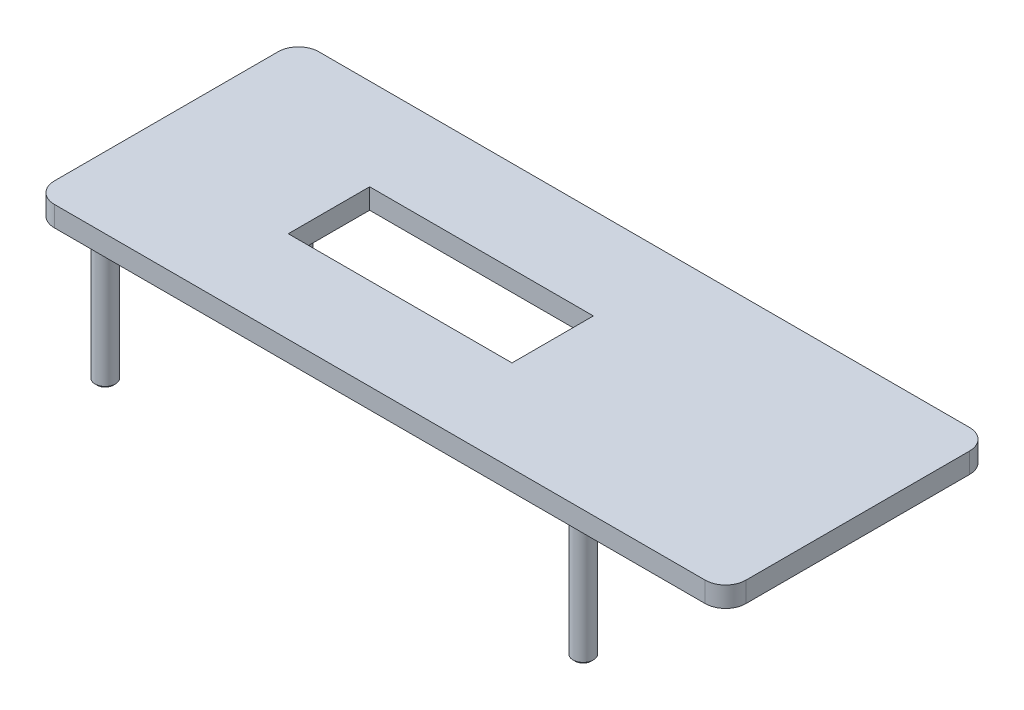
ISO-10303-21;
HEADER;
FILE_DESCRIPTION(('STEP AP214'),'2;1');
FILE_NAME('part.step','',(''),(''),'','','');
FILE_SCHEMA(('AUTOMOTIVE_DESIGN { 1 0 10303 214 1 1 1 1 }'));
ENDSEC;
DATA;
#1=APPLICATION_CONTEXT('core data for automotive mechanical design processes');
#2=APPLICATION_PROTOCOL_DEFINITION('international standard','automotive_design',2000,#1);
#3=PRODUCT_CONTEXT('',#1,'mechanical');
#4=PRODUCT('Part','Part','',(#3));
#5=PRODUCT_RELATED_PRODUCT_CATEGORY('part','',(#4));
#6=PRODUCT_DEFINITION_FORMATION('','',#4);
#7=PRODUCT_DEFINITION_CONTEXT('part definition',#1,'design');
#8=PRODUCT_DEFINITION('design','',#6,#7);
#9=PRODUCT_DEFINITION_SHAPE('','',#8);
#10=(LENGTH_UNIT() NAMED_UNIT(*) SI_UNIT(.MILLI.,.METRE.));
#11=(NAMED_UNIT(*) PLANE_ANGLE_UNIT() SI_UNIT($,.RADIAN.));
#12=(NAMED_UNIT(*) SI_UNIT($,.STERADIAN.) SOLID_ANGLE_UNIT());
#13=UNCERTAINTY_MEASURE_WITH_UNIT(LENGTH_MEASURE(1.E-05),#10,'distance_accuracy_value','');
#14=(GEOMETRIC_REPRESENTATION_CONTEXT(3) GLOBAL_UNCERTAINTY_ASSIGNED_CONTEXT((#13)) GLOBAL_UNIT_ASSIGNED_CONTEXT((#10,
#11,#12)) REPRESENTATION_CONTEXT('',''));
#15=CARTESIAN_POINT('',(0.,0.,0.));
#16=DIRECTION('',(0.,0.,1.));
#17=DIRECTION('',(1.,0.,0.));
#18=AXIS2_PLACEMENT_3D('',#15,#16,#17);
#19=CARTESIAN_POINT('',(16.,1.,-5.5));
#20=DIRECTION('',(0.,-1.,0.));
#21=DIRECTION('',(0.,0.,-1.));
#22=AXIS2_PLACEMENT_3D('',#19,#20,#21);
#23=CYLINDRICAL_SURFACE('',#22,1.);
#24=CARTESIAN_POINT('',(16.,0.,-5.5));
#25=DIRECTION('',(0.,1.,0.));
#26=DIRECTION('',(0.,0.,-1.));
#27=AXIS2_PLACEMENT_3D('',#24,#25,#26);
#28=CIRCLE('',#27,1.);
#29=CARTESIAN_POINT('',(17.,0.,-5.49999999999999));
#30=VERTEX_POINT('',#29);
#31=CARTESIAN_POINT('',(16.,0.,-6.5));
#32=VERTEX_POINT('',#31);
#33=EDGE_CURVE('E176',#30,#32,#28,.T.);
#34=ORIENTED_EDGE('',*,*,#33,.T.);
#35=DIRECTION('',(0.,-1.,0.));
#36=VECTOR('',#35,1.);
#37=CARTESIAN_POINT('',(16.,1.,-6.5));
#38=LINE('',#37,#36);
#39=CARTESIAN_POINT('',(16.,1.,-6.5));
#40=VERTEX_POINT('',#39);
#41=EDGE_CURVE('E254',#40,#32,#38,.T.);
#42=ORIENTED_EDGE('',*,*,#41,.F.);
#43=CARTESIAN_POINT('',(16.,1.,-5.5));
#44=DIRECTION('',(0.,1.,0.));
#45=DIRECTION('',(0.,0.,-1.));
#46=AXIS2_PLACEMENT_3D('',#43,#44,#45);
#47=CIRCLE('',#46,1.);
#48=CARTESIAN_POINT('',(17.,1.,-5.49999999999999));
#49=VERTEX_POINT('',#48);
#50=EDGE_CURVE('E177',#49,#40,#47,.T.);
#51=ORIENTED_EDGE('',*,*,#50,.F.);
#52=DIRECTION('',(0.,-1.,0.));
#53=VECTOR('',#52,1.);
#54=CARTESIAN_POINT('',(17.,1.,-5.49999999999999));
#55=LINE('',#54,#53);
#56=EDGE_CURVE('E203',#49,#30,#55,.T.);
#57=ORIENTED_EDGE('',*,*,#56,.T.);
#58=EDGE_LOOP('',(#34,#42,#51,#57));
#59=FACE_BOUND('',#58,.T.);
#60=ADVANCED_FACE('F41',(#59),#23,.T.);
#61=CARTESIAN_POINT('',(-16.,1.,-6.5));
#62=DIRECTION('',(0.,0.,1.));
#63=DIRECTION('',(1.,0.,0.));
#64=AXIS2_PLACEMENT_3D('',#61,#62,#63);
#65=PLANE('',#64);
#66=DIRECTION('',(-1.,0.,0.));
#67=VECTOR('',#66,1.);
#68=CARTESIAN_POINT('',(-16.,0.,-6.5));
#69=LINE('',#68,#67);
#70=CARTESIAN_POINT('',(-16.,0.,-6.5));
#71=VERTEX_POINT('',#70);
#72=EDGE_CURVE('E207',#32,#71,#69,.T.);
#73=ORIENTED_EDGE('',*,*,#72,.T.);
#74=DIRECTION('',(0.,-1.,0.));
#75=VECTOR('',#74,1.);
#76=CARTESIAN_POINT('',(-16.,1.,-6.5));
#77=LINE('',#76,#75);
#78=CARTESIAN_POINT('',(-16.,1.,-6.5));
#79=VERTEX_POINT('',#78);
#80=EDGE_CURVE('E250',#79,#71,#77,.T.);
#81=ORIENTED_EDGE('',*,*,#80,.F.);
#82=DIRECTION('',(-1.,0.,0.));
#83=VECTOR('',#82,1.);
#84=CARTESIAN_POINT('',(-16.,1.,-6.5));
#85=LINE('',#84,#83);
#86=EDGE_CURVE('E181',#40,#79,#85,.T.);
#87=ORIENTED_EDGE('',*,*,#86,.F.);
#88=ORIENTED_EDGE('',*,*,#41,.T.);
#89=EDGE_LOOP('',(#73,#81,#87,#88));
#90=FACE_BOUND('',#89,.T.);
#91=ADVANCED_FACE('F308',(#90),#65,.F.);
#92=CARTESIAN_POINT('',(-16.,1.,-5.5));
#93=DIRECTION('',(0.,-1.,0.));
#94=DIRECTION('',(0.,0.,-1.));
#95=AXIS2_PLACEMENT_3D('',#92,#93,#94);
#96=CYLINDRICAL_SURFACE('',#95,1.);
#97=CARTESIAN_POINT('',(-16.,0.,-5.5));
#98=DIRECTION('',(0.,1.,0.));
#99=DIRECTION('',(0.,0.,-1.));
#100=AXIS2_PLACEMENT_3D('',#97,#98,#99);
#101=CIRCLE('',#100,1.);
#102=CARTESIAN_POINT('',(-17.,0.,-5.49999999999999));
#103=VERTEX_POINT('',#102);
#104=EDGE_CURVE('E210',#71,#103,#101,.T.);
#105=ORIENTED_EDGE('',*,*,#104,.T.);
#106=DIRECTION('',(0.,-1.,0.));
#107=VECTOR('',#106,1.);
#108=CARTESIAN_POINT('',(-17.,1.,-5.49999999999999));
#109=LINE('',#108,#107);
#110=CARTESIAN_POINT('',(-17.,1.,-5.49999999999999));
#111=VERTEX_POINT('',#110);
#112=EDGE_CURVE('E246',#111,#103,#109,.T.);
#113=ORIENTED_EDGE('',*,*,#112,.F.);
#114=CARTESIAN_POINT('',(-16.,1.,-5.5));
#115=DIRECTION('',(0.,1.,0.));
#116=DIRECTION('',(0.,0.,-1.));
#117=AXIS2_PLACEMENT_3D('',#114,#115,#116);
#118=CIRCLE('',#117,1.);
#119=EDGE_CURVE('E185',#79,#111,#118,.T.);
#120=ORIENTED_EDGE('',*,*,#119,.F.);
#121=ORIENTED_EDGE('',*,*,#80,.T.);
#122=EDGE_LOOP('',(#105,#113,#120,#121));
#123=FACE_BOUND('',#122,.T.);
#124=ADVANCED_FACE('F314',(#123),#96,.T.);
#125=CARTESIAN_POINT('',(-17.,1.,5.49999999999999));
#126=DIRECTION('',(1.,0.,0.));
#127=DIRECTION('',(0.,0.,-1.));
#128=AXIS2_PLACEMENT_3D('',#125,#126,#127);
#129=PLANE('',#128);
#130=DIRECTION('',(0.,0.,1.));
#131=VECTOR('',#130,1.);
#132=CARTESIAN_POINT('',(-17.,0.,5.49999999999999));
#133=LINE('',#132,#131);
#134=CARTESIAN_POINT('',(-17.,0.,5.49999999999999));
#135=VERTEX_POINT('',#134);
#136=EDGE_CURVE('E213',#103,#135,#133,.T.);
#137=ORIENTED_EDGE('',*,*,#136,.T.);
#138=DIRECTION('',(0.,-1.,0.));
#139=VECTOR('',#138,1.);
#140=CARTESIAN_POINT('',(-17.,1.,5.49999999999999));
#141=LINE('',#140,#139);
#142=CARTESIAN_POINT('',(-17.,1.,5.49999999999999));
#143=VERTEX_POINT('',#142);
#144=EDGE_CURVE('E242',#143,#135,#141,.T.);
#145=ORIENTED_EDGE('',*,*,#144,.F.);
#146=DIRECTION('',(0.,0.,1.));
#147=VECTOR('',#146,1.);
#148=CARTESIAN_POINT('',(-17.,1.,5.49999999999999));
#149=LINE('',#148,#147);
#150=EDGE_CURVE('E188',#111,#143,#149,.T.);
#151=ORIENTED_EDGE('',*,*,#150,.F.);
#152=ORIENTED_EDGE('',*,*,#112,.T.);
#153=EDGE_LOOP('',(#137,#145,#151,#152));
#154=FACE_BOUND('',#153,.T.);
#155=ADVANCED_FACE('F374',(#154),#129,.F.);
#156=CARTESIAN_POINT('',(-16.,1.,5.5));
#157=DIRECTION('',(0.,-1.,0.));
#158=DIRECTION('',(0.,0.,-1.));
#159=AXIS2_PLACEMENT_3D('',#156,#157,#158);
#160=CYLINDRICAL_SURFACE('',#159,1.);
#161=CARTESIAN_POINT('',(-16.,0.,5.5));
#162=DIRECTION('',(0.,1.,0.));
#163=DIRECTION('',(0.,0.,-1.));
#164=AXIS2_PLACEMENT_3D('',#161,#162,#163);
#165=CIRCLE('',#164,1.);
#166=CARTESIAN_POINT('',(-16.,0.,6.5));
#167=VERTEX_POINT('',#166);
#168=EDGE_CURVE('E216',#135,#167,#165,.T.);
#169=ORIENTED_EDGE('',*,*,#168,.T.);
#170=DIRECTION('',(0.,-1.,0.));
#171=VECTOR('',#170,1.);
#172=CARTESIAN_POINT('',(-16.,1.,6.5));
#173=LINE('',#172,#171);
#174=CARTESIAN_POINT('',(-16.,1.,6.5));
#175=VERTEX_POINT('',#174);
#176=EDGE_CURVE('E238',#175,#167,#173,.T.);
#177=ORIENTED_EDGE('',*,*,#176,.F.);
#178=CARTESIAN_POINT('',(-16.,1.,5.5));
#179=DIRECTION('',(0.,1.,0.));
#180=DIRECTION('',(0.,0.,-1.));
#181=AXIS2_PLACEMENT_3D('',#178,#179,#180);
#182=CIRCLE('',#181,1.);
#183=EDGE_CURVE('E191',#143,#175,#182,.T.);
#184=ORIENTED_EDGE('',*,*,#183,.F.);
#185=ORIENTED_EDGE('',*,*,#144,.T.);
#186=EDGE_LOOP('',(#169,#177,#184,#185));
#187=FACE_BOUND('',#186,.T.);
#188=ADVANCED_FACE('F370',(#187),#160,.T.);
#189=CARTESIAN_POINT('',(-16.,1.,6.5));
#190=DIRECTION('',(0.,0.,-1.));
#191=DIRECTION('',(-1.,0.,0.));
#192=AXIS2_PLACEMENT_3D('',#189,#190,#191);
#193=PLANE('',#192);
#194=DIRECTION('',(1.,0.,0.));
#195=VECTOR('',#194,1.);
#196=CARTESIAN_POINT('',(-16.,0.,6.5));
#197=LINE('',#196,#195);
#198=CARTESIAN_POINT('',(16.,0.,6.5));
#199=VERTEX_POINT('',#198);
#200=EDGE_CURVE('E219',#167,#199,#197,.T.);
#201=ORIENTED_EDGE('',*,*,#200,.T.);
#202=DIRECTION('',(0.,-1.,0.));
#203=VECTOR('',#202,1.);
#204=CARTESIAN_POINT('',(16.,1.,6.5));
#205=LINE('',#204,#203);
#206=CARTESIAN_POINT('',(16.,1.,6.5));
#207=VERTEX_POINT('',#206);
#208=EDGE_CURVE('E234',#207,#199,#205,.T.);
#209=ORIENTED_EDGE('',*,*,#208,.F.);
#210=DIRECTION('',(1.,0.,0.));
#211=VECTOR('',#210,1.);
#212=CARTESIAN_POINT('',(-16.,1.,6.5));
#213=LINE('',#212,#211);
#214=EDGE_CURVE('E194',#175,#207,#213,.T.);
#215=ORIENTED_EDGE('',*,*,#214,.F.);
#216=ORIENTED_EDGE('',*,*,#176,.T.);
#217=EDGE_LOOP('',(#201,#209,#215,#216));
#218=FACE_BOUND('',#217,.T.);
#219=ADVANCED_FACE('F366',(#218),#193,.F.);
#220=CARTESIAN_POINT('',(16.,1.,5.5));
#221=DIRECTION('',(0.,-1.,0.));
#222=DIRECTION('',(0.,0.,-1.));
#223=AXIS2_PLACEMENT_3D('',#220,#221,#222);
#224=CYLINDRICAL_SURFACE('',#223,1.);
#225=CARTESIAN_POINT('',(16.,0.,5.5));
#226=DIRECTION('',(0.,1.,0.));
#227=DIRECTION('',(0.,0.,1.));
#228=AXIS2_PLACEMENT_3D('',#225,#226,#227);
#229=CIRCLE('',#228,1.);
#230=CARTESIAN_POINT('',(17.,0.,5.49999999999999));
#231=VERTEX_POINT('',#230);
#232=EDGE_CURVE('E222',#199,#231,#229,.T.);
#233=ORIENTED_EDGE('',*,*,#232,.T.);
#234=DIRECTION('',(0.,-1.,0.));
#235=VECTOR('',#234,1.);
#236=CARTESIAN_POINT('',(17.,1.,5.49999999999999));
#237=LINE('',#236,#235);
#238=CARTESIAN_POINT('',(17.,1.,5.49999999999999));
#239=VERTEX_POINT('',#238);
#240=EDGE_CURVE('E230',#239,#231,#237,.T.);
#241=ORIENTED_EDGE('',*,*,#240,.F.);
#242=CARTESIAN_POINT('',(16.,1.,5.5));
#243=DIRECTION('',(0.,1.,0.));
#244=DIRECTION('',(0.,0.,1.));
#245=AXIS2_PLACEMENT_3D('',#242,#243,#244);
#246=CIRCLE('',#245,1.);
#247=EDGE_CURVE('E197',#207,#239,#246,.T.);
#248=ORIENTED_EDGE('',*,*,#247,.F.);
#249=ORIENTED_EDGE('',*,*,#208,.T.);
#250=EDGE_LOOP('',(#233,#241,#248,#249));
#251=FACE_BOUND('',#250,.T.);
#252=ADVANCED_FACE('F362',(#251),#224,.T.);
#253=CARTESIAN_POINT('',(17.,1.,5.49999999999999));
#254=DIRECTION('',(-1.,0.,0.));
#255=DIRECTION('',(0.,0.,1.));
#256=AXIS2_PLACEMENT_3D('',#253,#254,#255);
#257=PLANE('',#256);
#258=DIRECTION('',(0.,0.,-1.));
#259=VECTOR('',#258,1.);
#260=CARTESIAN_POINT('',(17.,0.,5.49999999999999));
#261=LINE('',#260,#259);
#262=EDGE_CURVE('E182',#231,#30,#261,.T.);
#263=ORIENTED_EDGE('',*,*,#262,.T.);
#264=ORIENTED_EDGE('',*,*,#56,.F.);
#265=DIRECTION('',(0.,0.,-1.));
#266=VECTOR('',#265,1.);
#267=CARTESIAN_POINT('',(17.,1.,5.49999999999999));
#268=LINE('',#267,#266);
#269=EDGE_CURVE('E200',#239,#49,#268,.T.);
#270=ORIENTED_EDGE('',*,*,#269,.F.);
#271=ORIENTED_EDGE('',*,*,#240,.T.);
#272=EDGE_LOOP('',(#263,#264,#270,#271));
#273=FACE_BOUND('',#272,.T.);
#274=ADVANCED_FACE('F356',(#273),#257,.F.);
#275=CARTESIAN_POINT('',(16.,1.,-5.5));
#276=DIRECTION('',(0.,-1.,0.));
#277=DIRECTION('',(0.,0.,-1.));
#278=AXIS2_PLACEMENT_3D('',#275,#276,#277);
#279=PLANE('',#278);
#280=DIRECTION('',(1.,0.,0.));
#281=VECTOR('',#280,1.);
#282=CARTESIAN_POINT('',(16.,1.,-2.));
#283=LINE('',#282,#281);
#284=CARTESIAN_POINT('',(-9.,1.,-2.));
#285=VERTEX_POINT('',#284);
#286=CARTESIAN_POINT('',(2.,1.,-2.));
#287=VERTEX_POINT('',#286);
#288=EDGE_CURVE('E128',#285,#287,#283,.T.);
#289=ORIENTED_EDGE('',*,*,#288,.T.);
#290=DIRECTION('',(0.,0.,1.));
#291=VECTOR('',#290,1.);
#292=CARTESIAN_POINT('',(2.,1.,-5.5));
#293=LINE('',#292,#291);
#294=CARTESIAN_POINT('',(2.,1.,2.));
#295=VERTEX_POINT('',#294);
#296=EDGE_CURVE('E154',#287,#295,#293,.T.);
#297=ORIENTED_EDGE('',*,*,#296,.T.);
#298=DIRECTION('',(-1.,0.,0.));
#299=VECTOR('',#298,1.);
#300=CARTESIAN_POINT('',(16.,1.,2.));
#301=LINE('',#300,#299);
#302=CARTESIAN_POINT('',(-9.,1.,2.));
#303=VERTEX_POINT('',#302);
#304=EDGE_CURVE('E150',#295,#303,#301,.T.);
#305=ORIENTED_EDGE('',*,*,#304,.T.);
#306=DIRECTION('',(0.,0.,-1.));
#307=VECTOR('',#306,1.);
#308=CARTESIAN_POINT('',(-9.,1.,-5.5));
#309=LINE('',#308,#307);
#310=EDGE_CURVE('E134',#303,#285,#309,.T.);
#311=ORIENTED_EDGE('',*,*,#310,.T.);
#312=EDGE_LOOP('',(#289,#297,#305,#311));
#313=FACE_BOUND('',#312,.T.);
#314=ORIENTED_EDGE('',*,*,#50,.T.);
#315=ORIENTED_EDGE('',*,*,#86,.T.);
#316=ORIENTED_EDGE('',*,*,#119,.T.);
#317=ORIENTED_EDGE('',*,*,#150,.T.);
#318=ORIENTED_EDGE('',*,*,#183,.T.);
#319=ORIENTED_EDGE('',*,*,#214,.T.);
#320=ORIENTED_EDGE('',*,*,#247,.T.);
#321=ORIENTED_EDGE('',*,*,#269,.T.);
#322=EDGE_LOOP('',(#314,#315,#316,#317,#318,#319,#320,#321));
#323=FACE_BOUND('',#322,.T.);
#324=ADVANCED_FACE('F148',(#313,#323),#279,.F.);
#325=CARTESIAN_POINT('',(16.,0.,-5.5));
#326=DIRECTION('',(0.,-1.,0.));
#327=DIRECTION('',(0.,0.,-1.));
#328=AXIS2_PLACEMENT_3D('',#325,#326,#327);
#329=PLANE('',#328);
#330=DIRECTION('',(0.,0.,1.));
#331=VECTOR('',#330,1.);
#332=CARTESIAN_POINT('',(2.,0.,-5.5));
#333=LINE('',#332,#331);
#334=CARTESIAN_POINT('',(2.,0.,-2.));
#335=VERTEX_POINT('',#334);
#336=CARTESIAN_POINT('',(2.,0.,2.));
#337=VERTEX_POINT('',#336);
#338=EDGE_CURVE('E266',#335,#337,#333,.T.);
#339=ORIENTED_EDGE('',*,*,#338,.F.);
#340=DIRECTION('',(1.,0.,0.));
#341=VECTOR('',#340,1.);
#342=CARTESIAN_POINT('',(16.,0.,-2.));
#343=LINE('',#342,#341);
#344=CARTESIAN_POINT('',(-9.,0.,-2.));
#345=VERTEX_POINT('',#344);
#346=EDGE_CURVE('E258',#345,#335,#343,.T.);
#347=ORIENTED_EDGE('',*,*,#346,.F.);
#348=DIRECTION('',(0.,0.,-1.));
#349=VECTOR('',#348,1.);
#350=CARTESIAN_POINT('',(-9.,0.,-5.5));
#351=LINE('',#350,#349);
#352=CARTESIAN_POINT('',(-9.,0.,2.));
#353=VERTEX_POINT('',#352);
#354=EDGE_CURVE('E142',#353,#345,#351,.T.);
#355=ORIENTED_EDGE('',*,*,#354,.F.);
#356=DIRECTION('',(-1.,0.,0.));
#357=VECTOR('',#356,1.);
#358=CARTESIAN_POINT('',(16.,0.,2.));
#359=LINE('',#358,#357);
#360=EDGE_CURVE('E263',#337,#353,#359,.T.);
#361=ORIENTED_EDGE('',*,*,#360,.F.);
#362=EDGE_LOOP('',(#339,#347,#355,#361));
#363=FACE_BOUND('',#362,.T.);
#364=CARTESIAN_POINT('',(-15.25,0.,-4.75));
#365=DIRECTION('',(0.,-1.,0.));
#366=DIRECTION('',(0.,0.,1.));
#367=AXIS2_PLACEMENT_3D('',#364,#365,#366);
#368=CIRCLE('',#367,0.500000000000001);
#369=CARTESIAN_POINT('',(-15.25,0.,-4.25));
#370=VERTEX_POINT('',#369);
#371=EDGE_CURVE('E160',#370,#370,#368,.T.);
#372=ORIENTED_EDGE('',*,*,#371,.F.);
#373=EDGE_LOOP('',(#372));
#374=FACE_BOUND('',#373,.T.);
#375=CARTESIAN_POINT('',(8.25,0.,-4.75));
#376=DIRECTION('',(0.,-1.,0.));
#377=DIRECTION('',(0.,0.,1.));
#378=AXIS2_PLACEMENT_3D('',#375,#376,#377);
#379=CIRCLE('',#378,0.500000000000001);
#380=CARTESIAN_POINT('',(8.25,0.,-4.25));
#381=VERTEX_POINT('',#380);
#382=EDGE_CURVE('E164',#381,#381,#379,.T.);
#383=ORIENTED_EDGE('',*,*,#382,.F.);
#384=EDGE_LOOP('',(#383));
#385=FACE_BOUND('',#384,.T.);
#386=CARTESIAN_POINT('',(8.25,0.,4.75));
#387=DIRECTION('',(0.,-1.,0.));
#388=DIRECTION('',(0.,0.,-1.));
#389=AXIS2_PLACEMENT_3D('',#386,#387,#388);
#390=CIRCLE('',#389,0.500000000000001);
#391=CARTESIAN_POINT('',(8.25,0.,4.25));
#392=VERTEX_POINT('',#391);
#393=EDGE_CURVE('E168',#392,#392,#390,.T.);
#394=ORIENTED_EDGE('',*,*,#393,.F.);
#395=EDGE_LOOP('',(#394));
#396=FACE_BOUND('',#395,.T.);
#397=CARTESIAN_POINT('',(-15.25,0.,4.75));
#398=DIRECTION('',(0.,-1.,0.));
#399=DIRECTION('',(0.,0.,-1.));
#400=AXIS2_PLACEMENT_3D('',#397,#398,#399);
#401=CIRCLE('',#400,0.500000000000001);
#402=CARTESIAN_POINT('',(-15.25,0.,4.25));
#403=VERTEX_POINT('',#402);
#404=EDGE_CURVE('E172',#403,#403,#401,.T.);
#405=ORIENTED_EDGE('',*,*,#404,.F.);
#406=EDGE_LOOP('',(#405));
#407=FACE_BOUND('',#406,.T.);
#408=ORIENTED_EDGE('',*,*,#33,.F.);
#409=ORIENTED_EDGE('',*,*,#262,.F.);
#410=ORIENTED_EDGE('',*,*,#232,.F.);
#411=ORIENTED_EDGE('',*,*,#200,.F.);
#412=ORIENTED_EDGE('',*,*,#168,.F.);
#413=ORIENTED_EDGE('',*,*,#136,.F.);
#414=ORIENTED_EDGE('',*,*,#104,.F.);
#415=ORIENTED_EDGE('',*,*,#72,.F.);
#416=EDGE_LOOP('',(#408,#409,#410,#411,#412,#413,#414,#415));
#417=FACE_BOUND('',#416,.T.);
#418=ADVANCED_FACE('F352',(#363,#374,#385,#396,#407,#417),#329,.T.);
#419=CARTESIAN_POINT('',(-15.25,-7.,4.75));
#420=DIRECTION('',(0.,1.,0.));
#421=DIRECTION('',(0.,0.,1.));
#422=AXIS2_PLACEMENT_3D('',#419,#420,#421);
#423=CYLINDRICAL_SURFACE('',#422,0.500000000000001);
#424=CARTESIAN_POINT('',(-15.25,-6.9,4.75));
#425=DIRECTION('',(0.,-1.,0.));
#426=DIRECTION('',(0.,0.,-1.));
#427=AXIS2_PLACEMENT_3D('',#424,#425,#426);
#428=CIRCLE('',#427,0.500000000000001);
#429=CARTESIAN_POINT('',(-15.25,-6.9,4.25));
#430=VERTEX_POINT('',#429);
#431=EDGE_CURVE('E11',#430,#430,#428,.F.);
#432=ORIENTED_EDGE('',*,*,#431,.T.);
#433=EDGE_LOOP('',(#432));
#434=FACE_BOUND('',#433,.T.);
#435=ORIENTED_EDGE('',*,*,#404,.T.);
#436=EDGE_LOOP('',(#435));
#437=FACE_BOUND('',#436,.T.);
#438=ADVANCED_FACE('F349',(#434,#437),#423,.T.);
#439=CARTESIAN_POINT('',(-15.25,-7.,4.75));
#440=DIRECTION('',(0.,-1.,0.));
#441=DIRECTION('',(0.,0.,-1.));
#442=AXIS2_PLACEMENT_3D('',#439,#440,#441);
#443=PLANE('',#442);
#444=CARTESIAN_POINT('',(-15.25,-7.,4.75));
#445=DIRECTION('',(0.,-1.,0.));
#446=DIRECTION('',(0.,0.,-1.));
#447=AXIS2_PLACEMENT_3D('',#444,#445,#446);
#448=CIRCLE('',#447,0.399999999999998);
#449=CARTESIAN_POINT('',(-15.25,-7.,4.35));
#450=VERTEX_POINT('',#449);
#451=EDGE_CURVE('E50',#450,#450,#448,.T.);
#452=ORIENTED_EDGE('',*,*,#451,.T.);
#453=EDGE_LOOP('',(#452));
#454=FACE_BOUND('',#453,.T.);
#455=ADVANCED_FACE('F296',(#454),#443,.T.);
#456=CARTESIAN_POINT('',(8.25,-7.,4.75));
#457=DIRECTION('',(0.,1.,0.));
#458=DIRECTION('',(0.,0.,1.));
#459=AXIS2_PLACEMENT_3D('',#456,#457,#458);
#460=CYLINDRICAL_SURFACE('',#459,0.500000000000001);
#461=CARTESIAN_POINT('',(8.25,-6.9,4.75));
#462=DIRECTION('',(0.,-1.,0.));
#463=DIRECTION('',(0.,0.,-1.));
#464=AXIS2_PLACEMENT_3D('',#461,#462,#463);
#465=CIRCLE('',#464,0.500000000000001);
#466=CARTESIAN_POINT('',(8.25,-6.9,4.25));
#467=VERTEX_POINT('',#466);
#468=EDGE_CURVE('E281',#467,#467,#465,.F.);
#469=ORIENTED_EDGE('',*,*,#468,.T.);
#470=EDGE_LOOP('',(#469));
#471=FACE_BOUND('',#470,.T.);
#472=ORIENTED_EDGE('',*,*,#393,.T.);
#473=EDGE_LOOP('',(#472));
#474=FACE_BOUND('',#473,.T.);
#475=ADVANCED_FACE('F334',(#471,#474),#460,.T.);
#476=CARTESIAN_POINT('',(8.25,-7.,4.75));
#477=DIRECTION('',(0.,-1.,0.));
#478=DIRECTION('',(0.,0.,-1.));
#479=AXIS2_PLACEMENT_3D('',#476,#477,#478);
#480=PLANE('',#479);
#481=CARTESIAN_POINT('',(8.25,-7.,4.75));
#482=DIRECTION('',(0.,-1.,0.));
#483=DIRECTION('',(0.,0.,-1.));
#484=AXIS2_PLACEMENT_3D('',#481,#482,#483);
#485=CIRCLE('',#484,0.399999999999998);
#486=CARTESIAN_POINT('',(8.25,-7.,4.35));
#487=VERTEX_POINT('',#486);
#488=EDGE_CURVE('E277',#487,#487,#485,.T.);
#489=ORIENTED_EDGE('',*,*,#488,.T.);
#490=EDGE_LOOP('',(#489));
#491=FACE_BOUND('',#490,.T.);
#492=ADVANCED_FACE('F331',(#491),#480,.T.);
#493=CARTESIAN_POINT('',(8.25,-7.,-4.75));
#494=DIRECTION('',(0.,1.,0.));
#495=DIRECTION('',(0.,0.,1.));
#496=AXIS2_PLACEMENT_3D('',#493,#494,#495);
#497=CYLINDRICAL_SURFACE('',#496,0.500000000000001);
#498=CARTESIAN_POINT('',(8.25,-6.9,-4.75));
#499=DIRECTION('',(0.,1.,0.));
#500=DIRECTION('',(0.,0.,1.));
#501=AXIS2_PLACEMENT_3D('',#498,#499,#500);
#502=CIRCLE('',#501,0.500000000000001);
#503=CARTESIAN_POINT('',(8.25,-6.9,-4.25));
#504=VERTEX_POINT('',#503);
#505=EDGE_CURVE('E273',#504,#504,#502,.T.);
#506=ORIENTED_EDGE('',*,*,#505,.T.);
#507=EDGE_LOOP('',(#506));
#508=FACE_BOUND('',#507,.T.);
#509=ORIENTED_EDGE('',*,*,#382,.T.);
#510=EDGE_LOOP('',(#509));
#511=FACE_BOUND('',#510,.T.);
#512=ADVANCED_FACE('F333',(#508,#511),#497,.T.);
#513=CARTESIAN_POINT('',(8.25,-7.,-4.75));
#514=DIRECTION('',(0.,1.,0.));
#515=DIRECTION('',(0.,0.,1.));
#516=AXIS2_PLACEMENT_3D('',#513,#514,#515);
#517=PLANE('',#516);
#518=CARTESIAN_POINT('',(8.25,-7.,-4.75));
#519=DIRECTION('',(0.,1.,0.));
#520=DIRECTION('',(0.,0.,1.));
#521=AXIS2_PLACEMENT_3D('',#518,#519,#520);
#522=CIRCLE('',#521,0.399999999999998);
#523=CARTESIAN_POINT('',(8.25,-7.,-4.35));
#524=VERTEX_POINT('',#523);
#525=EDGE_CURVE('E269',#524,#524,#522,.F.);
#526=ORIENTED_EDGE('',*,*,#525,.T.);
#527=EDGE_LOOP('',(#526));
#528=FACE_BOUND('',#527,.T.);
#529=ADVANCED_FACE('F340',(#528),#517,.F.);
#530=CARTESIAN_POINT('',(-15.25,-7.,-4.75));
#531=DIRECTION('',(0.,1.,0.));
#532=DIRECTION('',(0.,0.,1.));
#533=AXIS2_PLACEMENT_3D('',#530,#531,#532);
#534=CYLINDRICAL_SURFACE('',#533,0.500000000000001);
#535=CARTESIAN_POINT('',(-15.25,-6.9,-4.75));
#536=DIRECTION('',(0.,1.,0.));
#537=DIRECTION('',(0.,0.,1.));
#538=AXIS2_PLACEMENT_3D('',#535,#536,#537);
#539=CIRCLE('',#538,0.500000000000001);
#540=CARTESIAN_POINT('',(-15.25,-6.9,-4.25));
#541=VERTEX_POINT('',#540);
#542=EDGE_CURVE('E289',#541,#541,#539,.T.);
#543=ORIENTED_EDGE('',*,*,#542,.T.);
#544=EDGE_LOOP('',(#543));
#545=FACE_BOUND('',#544,.T.);
#546=ORIENTED_EDGE('',*,*,#371,.T.);
#547=EDGE_LOOP('',(#546));
#548=FACE_BOUND('',#547,.T.);
#549=ADVANCED_FACE('F468',(#545,#548),#534,.T.);
#550=CARTESIAN_POINT('',(-15.25,-7.,-4.75));
#551=DIRECTION('',(0.,1.,0.));
#552=DIRECTION('',(0.,0.,1.));
#553=AXIS2_PLACEMENT_3D('',#550,#551,#552);
#554=PLANE('',#553);
#555=CARTESIAN_POINT('',(-15.25,-7.,-4.75));
#556=DIRECTION('',(0.,1.,0.));
#557=DIRECTION('',(0.,0.,1.));
#558=AXIS2_PLACEMENT_3D('',#555,#556,#557);
#559=CIRCLE('',#558,0.399999999999998);
#560=CARTESIAN_POINT('',(-15.25,-7.,-4.35));
#561=VERTEX_POINT('',#560);
#562=EDGE_CURVE('E285',#561,#561,#559,.F.);
#563=ORIENTED_EDGE('',*,*,#562,.T.);
#564=EDGE_LOOP('',(#563));
#565=FACE_BOUND('',#564,.T.);
#566=ADVANCED_FACE('F477',(#565),#554,.F.);
#567=CARTESIAN_POINT('',(2.,-7.,2.));
#568=DIRECTION('',(1.,0.,0.));
#569=DIRECTION('',(0.,0.,-1.));
#570=AXIS2_PLACEMENT_3D('',#567,#568,#569);
#571=PLANE('',#570);
#572=DIRECTION('',(0.,1.,0.));
#573=VECTOR('',#572,1.);
#574=CARTESIAN_POINT('',(2.,-7.,-2.));
#575=LINE('',#574,#573);
#576=EDGE_CURVE('E57',#335,#287,#575,.T.);
#577=ORIENTED_EDGE('',*,*,#576,.F.);
#578=ORIENTED_EDGE('',*,*,#338,.T.);
#579=DIRECTION('',(0.,1.,0.));
#580=VECTOR('',#579,1.);
#581=CARTESIAN_POINT('',(2.,-7.,2.));
#582=LINE('',#581,#580);
#583=EDGE_CURVE('E135',#337,#295,#582,.T.);
#584=ORIENTED_EDGE('',*,*,#583,.T.);
#585=ORIENTED_EDGE('',*,*,#296,.F.);
#586=EDGE_LOOP('',(#577,#578,#584,#585));
#587=FACE_BOUND('',#586,.T.);
#588=ADVANCED_FACE('F487',(#587),#571,.F.);
#589=CARTESIAN_POINT('',(-9.,-7.,2.));
#590=DIRECTION('',(0.,0.,1.));
#591=DIRECTION('',(1.,0.,0.));
#592=AXIS2_PLACEMENT_3D('',#589,#590,#591);
#593=PLANE('',#592);
#594=ORIENTED_EDGE('',*,*,#583,.F.);
#595=ORIENTED_EDGE('',*,*,#360,.T.);
#596=DIRECTION('',(0.,1.,0.));
#597=VECTOR('',#596,1.);
#598=CARTESIAN_POINT('',(-9.,-7.,2.));
#599=LINE('',#598,#597);
#600=EDGE_CURVE('E145',#353,#303,#599,.T.);
#601=ORIENTED_EDGE('',*,*,#600,.T.);
#602=ORIENTED_EDGE('',*,*,#304,.F.);
#603=EDGE_LOOP('',(#594,#595,#601,#602));
#604=FACE_BOUND('',#603,.T.);
#605=ADVANCED_FACE('F523',(#604),#593,.F.);
#606=CARTESIAN_POINT('',(-9.,-7.,2.));
#607=DIRECTION('',(-1.,0.,0.));
#608=DIRECTION('',(0.,0.,1.));
#609=AXIS2_PLACEMENT_3D('',#606,#607,#608);
#610=PLANE('',#609);
#611=ORIENTED_EDGE('',*,*,#600,.F.);
#612=ORIENTED_EDGE('',*,*,#354,.T.);
#613=DIRECTION('',(0.,1.,0.));
#614=VECTOR('',#613,1.);
#615=CARTESIAN_POINT('',(-9.,-7.,-2.));
#616=LINE('',#615,#614);
#617=EDGE_CURVE('E62',#345,#285,#616,.T.);
#618=ORIENTED_EDGE('',*,*,#617,.T.);
#619=ORIENTED_EDGE('',*,*,#310,.F.);
#620=EDGE_LOOP('',(#611,#612,#618,#619));
#621=FACE_BOUND('',#620,.T.);
#622=ADVANCED_FACE('F139',(#621),#610,.F.);
#623=CARTESIAN_POINT('',(-9.,-7.,-2.));
#624=DIRECTION('',(0.,0.,-1.));
#625=DIRECTION('',(-1.,0.,0.));
#626=AXIS2_PLACEMENT_3D('',#623,#624,#625);
#627=PLANE('',#626);
#628=ORIENTED_EDGE('',*,*,#617,.F.);
#629=ORIENTED_EDGE('',*,*,#346,.T.);
#630=ORIENTED_EDGE('',*,*,#576,.T.);
#631=ORIENTED_EDGE('',*,*,#288,.F.);
#632=EDGE_LOOP('',(#628,#629,#630,#631));
#633=FACE_BOUND('',#632,.T.);
#634=ADVANCED_FACE('F129',(#633),#627,.F.);
#635=CARTESIAN_POINT('',(8.25,-7.,-4.75));
#636=DIRECTION('',(0.,1.,0.));
#637=DIRECTION('',(0.,0.,1.));
#638=AXIS2_PLACEMENT_3D('',#635,#636,#637);
#639=CONICAL_SURFACE('',#638,0.399999999999998,0.785398163397438);
#640=ORIENTED_EDGE('',*,*,#505,.F.);
#641=EDGE_LOOP('',(#640));
#642=FACE_BOUND('',#641,.T.);
#643=ORIENTED_EDGE('',*,*,#525,.F.);
#644=EDGE_LOOP('',(#643));
#645=FACE_BOUND('',#644,.T.);
#646=ADVANCED_FACE('F319',(#642,#645),#639,.T.);
#647=CARTESIAN_POINT('',(8.25,-7.,4.75));
#648=DIRECTION('',(0.,1.,0.));
#649=DIRECTION('',(0.,0.,1.));
#650=AXIS2_PLACEMENT_3D('',#647,#648,#649);
#651=CONICAL_SURFACE('',#650,0.399999999999998,0.785398163397438);
#652=ORIENTED_EDGE('',*,*,#468,.F.);
#653=EDGE_LOOP('',(#652));
#654=FACE_BOUND('',#653,.T.);
#655=ORIENTED_EDGE('',*,*,#488,.F.);
#656=EDGE_LOOP('',(#655));
#657=FACE_BOUND('',#656,.T.);
#658=ADVANCED_FACE('F304',(#654,#657),#651,.T.);
#659=CARTESIAN_POINT('',(-15.25,-7.,-4.75));
#660=DIRECTION('',(0.,1.,0.));
#661=DIRECTION('',(0.,0.,1.));
#662=AXIS2_PLACEMENT_3D('',#659,#660,#661);
#663=CONICAL_SURFACE('',#662,0.399999999999998,0.785398163397438);
#664=ORIENTED_EDGE('',*,*,#542,.F.);
#665=EDGE_LOOP('',(#664));
#666=FACE_BOUND('',#665,.T.);
#667=ORIENTED_EDGE('',*,*,#562,.F.);
#668=EDGE_LOOP('',(#667));
#669=FACE_BOUND('',#668,.T.);
#670=ADVANCED_FACE('F299',(#666,#669),#663,.T.);
#671=CARTESIAN_POINT('',(-15.25,-7.,4.75));
#672=DIRECTION('',(0.,1.,0.));
#673=DIRECTION('',(0.,0.,1.));
#674=AXIS2_PLACEMENT_3D('',#671,#672,#673);
#675=CONICAL_SURFACE('',#674,0.399999999999998,0.785398163397438);
#676=ORIENTED_EDGE('',*,*,#431,.F.);
#677=EDGE_LOOP('',(#676));
#678=FACE_BOUND('',#677,.T.);
#679=ORIENTED_EDGE('',*,*,#451,.F.);
#680=EDGE_LOOP('',(#679));
#681=FACE_BOUND('',#680,.T.);
#682=ADVANCED_FACE('F43',(#678,#681),#675,.T.);
#683=CLOSED_SHELL('',(#60,#91,#124,#155,#188,#219,#252,#274,#324,#418,#438,#455,#475,#492,#512,
#529,#549,#566,#588,#605,#622,#634,#646,#658,#670,#682));
#684=MANIFOLD_SOLID_BREP('B2',#683);
#685=ADVANCED_BREP_SHAPE_REPRESENTATION('',(#18,#684),#14);
#686=SHAPE_DEFINITION_REPRESENTATION(#9,#685);
ENDSEC;
END-ISO-10303-21;
